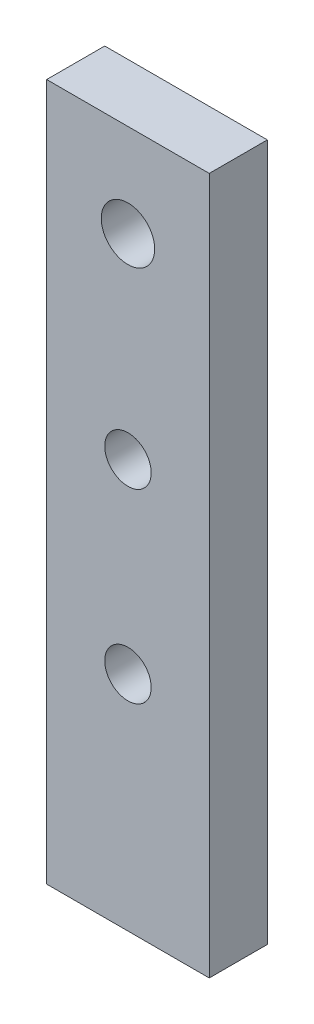
ISO-10303-21;
HEADER;
FILE_DESCRIPTION(('STEP AP214'),'2;1');
FILE_NAME('part.step','',(''),(''),'','','');
FILE_SCHEMA(('AUTOMOTIVE_DESIGN { 1 0 10303 214 1 1 1 1 }'));
ENDSEC;
DATA;
#1=APPLICATION_CONTEXT('core data for automotive mechanical design processes');
#2=APPLICATION_PROTOCOL_DEFINITION('international standard','automotive_design',2000,#1);
#3=PRODUCT_CONTEXT('',#1,'mechanical');
#4=PRODUCT('Part','Part','',(#3));
#5=PRODUCT_RELATED_PRODUCT_CATEGORY('part','',(#4));
#6=PRODUCT_DEFINITION_FORMATION('','',#4);
#7=PRODUCT_DEFINITION_CONTEXT('part definition',#1,'design');
#8=PRODUCT_DEFINITION('design','',#6,#7);
#9=PRODUCT_DEFINITION_SHAPE('','',#8);
#10=(LENGTH_UNIT() NAMED_UNIT(*) SI_UNIT(.MILLI.,.METRE.));
#11=(NAMED_UNIT(*) PLANE_ANGLE_UNIT() SI_UNIT($,.RADIAN.));
#12=(NAMED_UNIT(*) SI_UNIT($,.STERADIAN.) SOLID_ANGLE_UNIT());
#13=UNCERTAINTY_MEASURE_WITH_UNIT(LENGTH_MEASURE(1.E-05),#10,'distance_accuracy_value','');
#14=(GEOMETRIC_REPRESENTATION_CONTEXT(3) GLOBAL_UNCERTAINTY_ASSIGNED_CONTEXT((#13)) GLOBAL_UNIT_ASSIGNED_CONTEXT((#10,
#11,#12)) REPRESENTATION_CONTEXT('',''));
#15=CARTESIAN_POINT('',(0.,0.,0.));
#16=DIRECTION('',(0.,0.,1.));
#17=DIRECTION('',(1.,0.,0.));
#18=AXIS2_PLACEMENT_3D('',#15,#16,#17);
#19=CARTESIAN_POINT('',(8.89,38.1,0.));
#20=DIRECTION('',(1.,0.,0.));
#21=DIRECTION('',(0.,0.,-1.));
#22=AXIS2_PLACEMENT_3D('',#19,#20,#21);
#23=PLANE('',#22);
#24=DIRECTION('',(0.,0.,1.));
#25=VECTOR('',#24,1.);
#26=CARTESIAN_POINT('',(8.89,0.,0.));
#27=LINE('',#26,#25);
#28=CARTESIAN_POINT('',(8.89,0.,3.556));
#29=VERTEX_POINT('',#28);
#30=CARTESIAN_POINT('',(8.89,0.,6.731));
#31=VERTEX_POINT('',#30);
#32=EDGE_CURVE('E99',#29,#31,#27,.T.);
#33=ORIENTED_EDGE('',*,*,#32,.F.);
#34=DIRECTION('',(0.,-1.,0.));
#35=VECTOR('',#34,1.);
#36=CARTESIAN_POINT('',(8.89,38.1,3.556));
#37=LINE('',#36,#35);
#38=CARTESIAN_POINT('',(8.89,38.1,3.556));
#39=VERTEX_POINT('',#38);
#40=EDGE_CURVE('E11',#39,#29,#37,.T.);
#41=ORIENTED_EDGE('',*,*,#40,.F.);
#42=DIRECTION('',(0.,0.,1.));
#43=VECTOR('',#42,1.);
#44=CARTESIAN_POINT('',(8.89,38.1,0.));
#45=LINE('',#44,#43);
#46=CARTESIAN_POINT('',(8.89,38.1,6.731));
#47=VERTEX_POINT('',#46);
#48=EDGE_CURVE('E92',#39,#47,#45,.T.);
#49=ORIENTED_EDGE('',*,*,#48,.T.);
#50=DIRECTION('',(0.,-1.,0.));
#51=VECTOR('',#50,1.);
#52=CARTESIAN_POINT('',(8.89,38.1,6.731));
#53=LINE('',#52,#51);
#54=EDGE_CURVE('E73',#47,#31,#53,.T.);
#55=ORIENTED_EDGE('',*,*,#54,.T.);
#56=EDGE_LOOP('',(#33,#41,#49,#55));
#57=FACE_BOUND('',#56,.T.);
#58=ADVANCED_FACE('F35',(#57),#23,.T.);
#59=CARTESIAN_POINT('',(0.,38.1,3.556));
#60=DIRECTION('',(0.,0.,-1.));
#61=DIRECTION('',(-1.,0.,0.));
#62=AXIS2_PLACEMENT_3D('',#59,#60,#61);
#63=PLANE('',#62);
#64=CARTESIAN_POINT('',(4.445,33.02,3.556));
#65=DIRECTION('',(0.,0.,1.));
#66=DIRECTION('',(1.,0.,0.));
#67=AXIS2_PLACEMENT_3D('',#64,#65,#66);
#68=CIRCLE('',#67,1.4605);
#69=CARTESIAN_POINT('',(5.9055,33.02,3.556));
#70=VERTEX_POINT('',#69);
#71=EDGE_CURVE('E102',#70,#70,#68,.T.);
#72=ORIENTED_EDGE('',*,*,#71,.T.);
#73=EDGE_LOOP('',(#72));
#74=FACE_BOUND('',#73,.T.);
#75=CARTESIAN_POINT('',(4.445,12.1690836822925,3.556));
#76=DIRECTION('',(0.,0.,1.));
#77=DIRECTION('',(1.,0.,0.));
#78=AXIS2_PLACEMENT_3D('',#75,#76,#77);
#79=CIRCLE('',#78,1.27);
#80=CARTESIAN_POINT('',(5.715,12.1690836822925,3.556));
#81=VERTEX_POINT('',#80);
#82=EDGE_CURVE('E153',#81,#81,#79,.T.);
#83=ORIENTED_EDGE('',*,*,#82,.T.);
#84=EDGE_LOOP('',(#83));
#85=FACE_BOUND('',#84,.T.);
#86=CARTESIAN_POINT('',(4.445,22.3290836822925,3.556));
#87=DIRECTION('',(0.,0.,1.));
#88=DIRECTION('',(1.,0.,0.));
#89=AXIS2_PLACEMENT_3D('',#86,#87,#88);
#90=CIRCLE('',#89,1.27);
#91=CARTESIAN_POINT('',(5.715,22.3290836822925,3.556));
#92=VERTEX_POINT('',#91);
#93=EDGE_CURVE('E160',#92,#92,#90,.T.);
#94=ORIENTED_EDGE('',*,*,#93,.T.);
#95=EDGE_LOOP('',(#94));
#96=FACE_BOUND('',#95,.T.);
#97=DIRECTION('',(1.,0.,0.));
#98=VECTOR('',#97,1.);
#99=CARTESIAN_POINT('',(0.,0.,3.556));
#100=LINE('',#99,#98);
#101=CARTESIAN_POINT('',(0.,0.,3.556));
#102=VERTEX_POINT('',#101);
#103=EDGE_CURVE('E86',#102,#29,#100,.T.);
#104=ORIENTED_EDGE('',*,*,#103,.F.);
#105=DIRECTION('',(0.,-1.,0.));
#106=VECTOR('',#105,1.);
#107=CARTESIAN_POINT('',(0.,38.1,3.556));
#108=LINE('',#107,#106);
#109=CARTESIAN_POINT('',(0.,38.1,3.556));
#110=VERTEX_POINT('',#109);
#111=EDGE_CURVE('E43',#110,#102,#108,.T.);
#112=ORIENTED_EDGE('',*,*,#111,.F.);
#113=DIRECTION('',(1.,0.,0.));
#114=VECTOR('',#113,1.);
#115=CARTESIAN_POINT('',(0.,38.1,3.556));
#116=LINE('',#115,#114);
#117=EDGE_CURVE('E84',#110,#39,#116,.T.);
#118=ORIENTED_EDGE('',*,*,#117,.T.);
#119=ORIENTED_EDGE('',*,*,#40,.T.);
#120=EDGE_LOOP('',(#104,#112,#118,#119));
#121=FACE_BOUND('',#120,.T.);
#122=ADVANCED_FACE('F82',(#74,#85,#96,#121),#63,.T.);
#123=CARTESIAN_POINT('',(0.,38.1,0.));
#124=DIRECTION('',(1.,0.,0.));
#125=DIRECTION('',(0.,0.,-1.));
#126=AXIS2_PLACEMENT_3D('',#123,#124,#125);
#127=PLANE('',#126);
#128=DIRECTION('',(0.,0.,1.));
#129=VECTOR('',#128,1.);
#130=CARTESIAN_POINT('',(0.,0.,0.));
#131=LINE('',#130,#129);
#132=CARTESIAN_POINT('',(0.,0.,6.731));
#133=VERTEX_POINT('',#132);
#134=EDGE_CURVE('E66',#102,#133,#131,.T.);
#135=ORIENTED_EDGE('',*,*,#134,.T.);
#136=DIRECTION('',(0.,-1.,0.));
#137=VECTOR('',#136,1.);
#138=CARTESIAN_POINT('',(0.,38.1,6.731));
#139=LINE('',#138,#137);
#140=CARTESIAN_POINT('',(0.,38.1,6.731));
#141=VERTEX_POINT('',#140);
#142=EDGE_CURVE('E87',#141,#133,#139,.T.);
#143=ORIENTED_EDGE('',*,*,#142,.F.);
#144=DIRECTION('',(0.,0.,1.));
#145=VECTOR('',#144,1.);
#146=CARTESIAN_POINT('',(0.,38.1,0.));
#147=LINE('',#146,#145);
#148=EDGE_CURVE('E88',#110,#141,#147,.T.);
#149=ORIENTED_EDGE('',*,*,#148,.F.);
#150=ORIENTED_EDGE('',*,*,#111,.T.);
#151=EDGE_LOOP('',(#135,#143,#149,#150));
#152=FACE_BOUND('',#151,.T.);
#153=ADVANCED_FACE('F89',(#152),#127,.F.);
#154=CARTESIAN_POINT('',(0.,38.1,6.731));
#155=DIRECTION('',(0.,0.,-1.));
#156=DIRECTION('',(-1.,0.,0.));
#157=AXIS2_PLACEMENT_3D('',#154,#155,#156);
#158=PLANE('',#157);
#159=CARTESIAN_POINT('',(4.445,33.02,6.731));
#160=DIRECTION('',(0.,0.,1.));
#161=DIRECTION('',(1.,0.,0.));
#162=AXIS2_PLACEMENT_3D('',#159,#160,#161);
#163=CIRCLE('',#162,1.4605);
#164=CARTESIAN_POINT('',(5.9055,33.02,6.731));
#165=VERTEX_POINT('',#164);
#166=EDGE_CURVE('E148',#165,#165,#163,.T.);
#167=ORIENTED_EDGE('',*,*,#166,.F.);
#168=EDGE_LOOP('',(#167));
#169=FACE_BOUND('',#168,.T.);
#170=CARTESIAN_POINT('',(4.445,12.1690836822925,6.731));
#171=DIRECTION('',(0.,0.,1.));
#172=DIRECTION('',(1.,0.,0.));
#173=AXIS2_PLACEMENT_3D('',#170,#171,#172);
#174=CIRCLE('',#173,1.27);
#175=CARTESIAN_POINT('',(5.715,12.1690836822925,6.731));
#176=VERTEX_POINT('',#175);
#177=EDGE_CURVE('E149',#176,#176,#174,.T.);
#178=ORIENTED_EDGE('',*,*,#177,.F.);
#179=EDGE_LOOP('',(#178));
#180=FACE_BOUND('',#179,.T.);
#181=CARTESIAN_POINT('',(4.445,22.3290836822925,6.731));
#182=DIRECTION('',(0.,0.,1.));
#183=DIRECTION('',(1.,0.,0.));
#184=AXIS2_PLACEMENT_3D('',#181,#182,#183);
#185=CIRCLE('',#184,1.27);
#186=CARTESIAN_POINT('',(5.715,22.3290836822925,6.731));
#187=VERTEX_POINT('',#186);
#188=EDGE_CURVE('E158',#187,#187,#185,.T.);
#189=ORIENTED_EDGE('',*,*,#188,.F.);
#190=EDGE_LOOP('',(#189));
#191=FACE_BOUND('',#190,.T.);
#192=DIRECTION('',(1.,0.,0.));
#193=VECTOR('',#192,1.);
#194=CARTESIAN_POINT('',(0.,0.,6.731));
#195=LINE('',#194,#193);
#196=EDGE_CURVE('E94',#133,#31,#195,.T.);
#197=ORIENTED_EDGE('',*,*,#196,.T.);
#198=ORIENTED_EDGE('',*,*,#54,.F.);
#199=DIRECTION('',(1.,0.,0.));
#200=VECTOR('',#199,1.);
#201=CARTESIAN_POINT('',(0.,38.1,6.731));
#202=LINE('',#201,#200);
#203=EDGE_CURVE('E51',#141,#47,#202,.T.);
#204=ORIENTED_EDGE('',*,*,#203,.F.);
#205=ORIENTED_EDGE('',*,*,#142,.T.);
#206=EDGE_LOOP('',(#197,#198,#204,#205));
#207=FACE_BOUND('',#206,.T.);
#208=ADVANCED_FACE('F109',(#169,#180,#191,#207),#158,.F.);
#209=CARTESIAN_POINT('',(0.,38.1,0.));
#210=DIRECTION('',(0.,1.,0.));
#211=DIRECTION('',(0.,0.,1.));
#212=AXIS2_PLACEMENT_3D('',#209,#210,#211);
#213=PLANE('',#212);
#214=ORIENTED_EDGE('',*,*,#48,.F.);
#215=ORIENTED_EDGE('',*,*,#117,.F.);
#216=ORIENTED_EDGE('',*,*,#148,.T.);
#217=ORIENTED_EDGE('',*,*,#203,.T.);
#218=EDGE_LOOP('',(#214,#215,#216,#217));
#219=FACE_BOUND('',#218,.T.);
#220=ADVANCED_FACE('F91',(#219),#213,.T.);
#221=CARTESIAN_POINT('',(0.,0.,0.));
#222=DIRECTION('',(0.,1.,0.));
#223=DIRECTION('',(0.,0.,1.));
#224=AXIS2_PLACEMENT_3D('',#221,#222,#223);
#225=PLANE('',#224);
#226=ORIENTED_EDGE('',*,*,#32,.T.);
#227=ORIENTED_EDGE('',*,*,#196,.F.);
#228=ORIENTED_EDGE('',*,*,#134,.F.);
#229=ORIENTED_EDGE('',*,*,#103,.T.);
#230=EDGE_LOOP('',(#226,#227,#228,#229));
#231=FACE_BOUND('',#230,.T.);
#232=ADVANCED_FACE('F111',(#231),#225,.F.);
#233=CARTESIAN_POINT('',(4.445,22.3290836822925,3.556));
#234=DIRECTION('',(0.,0.,1.));
#235=DIRECTION('',(1.,0.,0.));
#236=AXIS2_PLACEMENT_3D('',#233,#234,#235);
#237=CYLINDRICAL_SURFACE('',#236,1.27);
#238=ORIENTED_EDGE('',*,*,#93,.F.);
#239=EDGE_LOOP('',(#238));
#240=FACE_BOUND('',#239,.T.);
#241=ORIENTED_EDGE('',*,*,#188,.T.);
#242=EDGE_LOOP('',(#241));
#243=FACE_BOUND('',#242,.T.);
#244=ADVANCED_FACE('F129',(#240,#243),#237,.F.);
#245=CARTESIAN_POINT('',(4.445,12.1690836822925,3.556));
#246=DIRECTION('',(0.,0.,1.));
#247=DIRECTION('',(1.,0.,0.));
#248=AXIS2_PLACEMENT_3D('',#245,#246,#247);
#249=CYLINDRICAL_SURFACE('',#248,1.27);
#250=ORIENTED_EDGE('',*,*,#82,.F.);
#251=EDGE_LOOP('',(#250));
#252=FACE_BOUND('',#251,.T.);
#253=ORIENTED_EDGE('',*,*,#177,.T.);
#254=EDGE_LOOP('',(#253));
#255=FACE_BOUND('',#254,.T.);
#256=ADVANCED_FACE('F134',(#252,#255),#249,.F.);
#257=CARTESIAN_POINT('',(4.445,33.02,3.556));
#258=DIRECTION('',(0.,0.,1.));
#259=DIRECTION('',(1.,0.,0.));
#260=AXIS2_PLACEMENT_3D('',#257,#258,#259);
#261=CYLINDRICAL_SURFACE('',#260,1.4605);
#262=ORIENTED_EDGE('',*,*,#71,.F.);
#263=EDGE_LOOP('',(#262));
#264=FACE_BOUND('',#263,.T.);
#265=ORIENTED_EDGE('',*,*,#166,.T.);
#266=EDGE_LOOP('',(#265));
#267=FACE_BOUND('',#266,.T.);
#268=ADVANCED_FACE('F138',(#264,#267),#261,.F.);
#269=CLOSED_SHELL('',(#58,#122,#153,#208,#220,#232,#244,#256,#268));
#270=MANIFOLD_SOLID_BREP('B2',#269);
#271=ADVANCED_BREP_SHAPE_REPRESENTATION('',(#18,#270),#14);
#272=SHAPE_DEFINITION_REPRESENTATION(#9,#271);
ENDSEC;
END-ISO-10303-21;
